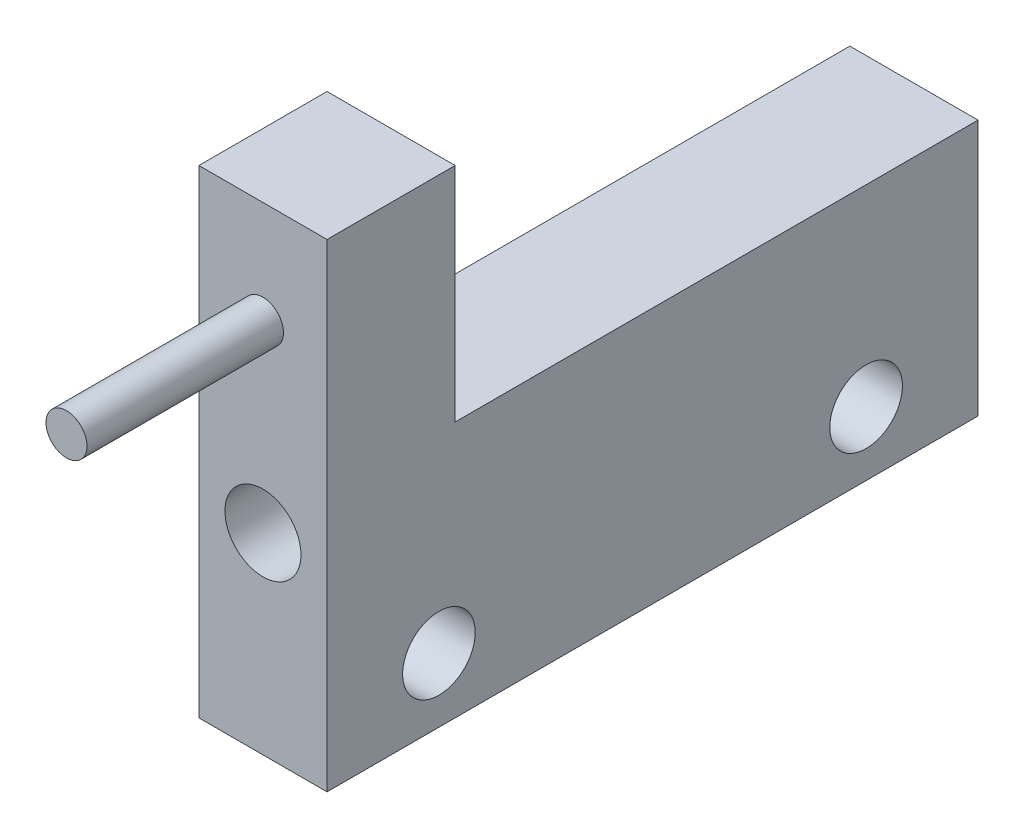
ISO-10303-21;
HEADER;
FILE_DESCRIPTION(('STEP AP214'),'2;1');
FILE_NAME('part.step','',(''),(''),'','','');
FILE_SCHEMA(('AUTOMOTIVE_DESIGN { 1 0 10303 214 1 1 1 1 }'));
ENDSEC;
DATA;
#1=APPLICATION_CONTEXT('core data for automotive mechanical design processes');
#2=APPLICATION_PROTOCOL_DEFINITION('international standard','automotive_design',2000,#1);
#3=PRODUCT_CONTEXT('',#1,'mechanical');
#4=PRODUCT('Part','Part','',(#3));
#5=PRODUCT_RELATED_PRODUCT_CATEGORY('part','',(#4));
#6=PRODUCT_DEFINITION_FORMATION('','',#4);
#7=PRODUCT_DEFINITION_CONTEXT('part definition',#1,'design');
#8=PRODUCT_DEFINITION('design','',#6,#7);
#9=PRODUCT_DEFINITION_SHAPE('','',#8);
#10=(LENGTH_UNIT() NAMED_UNIT(*) SI_UNIT(.MILLI.,.METRE.));
#11=(NAMED_UNIT(*) PLANE_ANGLE_UNIT() SI_UNIT($,.RADIAN.));
#12=(NAMED_UNIT(*) SI_UNIT($,.STERADIAN.) SOLID_ANGLE_UNIT());
#13=UNCERTAINTY_MEASURE_WITH_UNIT(LENGTH_MEASURE(1.E-05),#10,'distance_accuracy_value','');
#14=(GEOMETRIC_REPRESENTATION_CONTEXT(3) GLOBAL_UNCERTAINTY_ASSIGNED_CONTEXT((#13)) GLOBAL_UNIT_ASSIGNED_CONTEXT((#10,
#11,#12)) REPRESENTATION_CONTEXT('',''));
#15=CARTESIAN_POINT('',(0.,0.,0.));
#16=DIRECTION('',(0.,0.,1.));
#17=DIRECTION('',(1.,0.,0.));
#18=AXIS2_PLACEMENT_3D('',#15,#16,#17);
#19=CARTESIAN_POINT('',(-18.4539909866967,39.1927618098416,76.2));
#20=DIRECTION('',(0.,-1.,0.));
#21=DIRECTION('',(0.,0.,-1.));
#22=AXIS2_PLACEMENT_3D('',#19,#20,#21);
#23=PLANE('',#22);
#24=DIRECTION('',(-1.,0.,0.));
#25=VECTOR('',#24,1.);
#26=CARTESIAN_POINT('',(-3.45399098669674,39.1927618098416,61.2));
#27=LINE('',#26,#25);
#28=CARTESIAN_POINT('',(-3.45399098669674,39.1927618098416,61.2));
#29=VERTEX_POINT('',#28);
#30=CARTESIAN_POINT('',(-18.4539909866967,39.1927618098416,61.2));
#31=VERTEX_POINT('',#30);
#32=EDGE_CURVE('E51',#29,#31,#27,.T.);
#33=ORIENTED_EDGE('',*,*,#32,.F.);
#34=DIRECTION('',(0.,0.,-1.));
#35=VECTOR('',#34,1.);
#36=CARTESIAN_POINT('',(-3.45399098669674,39.1927618098416,76.2));
#37=LINE('',#36,#35);
#38=CARTESIAN_POINT('',(-3.45399098669674,39.1927618098416,0.));
#39=VERTEX_POINT('',#38);
#40=EDGE_CURVE('E87',#29,#39,#37,.T.);
#41=ORIENTED_EDGE('',*,*,#40,.T.);
#42=DIRECTION('',(-1.,0.,0.));
#43=VECTOR('',#42,1.);
#44=CARTESIAN_POINT('',(-18.4539909866967,39.1927618098416,0.));
#45=LINE('',#44,#43);
#46=CARTESIAN_POINT('',(-18.4539909866967,39.1927618098416,0.));
#47=VERTEX_POINT('',#46);
#48=EDGE_CURVE('E91',#39,#47,#45,.T.);
#49=ORIENTED_EDGE('',*,*,#48,.T.);
#50=DIRECTION('',(0.,0.,-1.));
#51=VECTOR('',#50,1.);
#52=CARTESIAN_POINT('',(-18.4539909866967,39.1927618098416,76.2));
#53=LINE('',#52,#51);
#54=EDGE_CURVE('E78',#31,#47,#53,.T.);
#55=ORIENTED_EDGE('',*,*,#54,.F.);
#56=EDGE_LOOP('',(#33,#41,#49,#55));
#57=FACE_BOUND('',#56,.T.);
#58=ADVANCED_FACE('F36',(#57),#23,.F.);
#59=CARTESIAN_POINT('',(0.,0.,76.2));
#60=DIRECTION('',(0.,0.,1.));
#61=DIRECTION('',(1.,0.,0.));
#62=AXIS2_PLACEMENT_3D('',#59,#60,#61);
#63=PLANE('',#62);
#64=CARTESIAN_POINT('',(-10.9539909866967,53.1927618098416,76.2));
#65=DIRECTION('',(0.,0.,1.));
#66=DIRECTION('',(1.,0.,0.));
#67=AXIS2_PLACEMENT_3D('',#64,#65,#66);
#68=CIRCLE('',#67,2.4);
#69=CARTESIAN_POINT('',(-8.55399098669673,53.1927618098416,76.2));
#70=VERTEX_POINT('',#69);
#71=EDGE_CURVE('E144',#70,#70,#68,.T.);
#72=ORIENTED_EDGE('',*,*,#71,.F.);
#73=EDGE_LOOP('',(#72));
#74=FACE_BOUND('',#73,.T.);
#75=DIRECTION('',(0.,-1.,0.));
#76=VECTOR('',#75,1.);
#77=CARTESIAN_POINT('',(-18.4539909866967,39.1927618098416,76.2));
#78=LINE('',#77,#76);
#79=CARTESIAN_POINT('',(-18.4539909866967,65.1927618098416,76.2));
#80=VERTEX_POINT('',#79);
#81=CARTESIAN_POINT('',(-18.4539909866967,9.19276180984159,76.2));
#82=VERTEX_POINT('',#81);
#83=EDGE_CURVE('E95',#80,#82,#78,.T.);
#84=ORIENTED_EDGE('',*,*,#83,.T.);
#85=DIRECTION('',(1.,0.,0.));
#86=VECTOR('',#85,1.);
#87=CARTESIAN_POINT('',(-18.4539909866967,9.19276180984159,76.2));
#88=LINE('',#87,#86);
#89=CARTESIAN_POINT('',(-3.45399098669673,9.19276180984159,76.2));
#90=VERTEX_POINT('',#89);
#91=EDGE_CURVE('E60',#82,#90,#88,.T.);
#92=ORIENTED_EDGE('',*,*,#91,.T.);
#93=DIRECTION('',(0.,1.,0.));
#94=VECTOR('',#93,1.);
#95=CARTESIAN_POINT('',(-3.45399098669674,39.1927618098416,76.2));
#96=LINE('',#95,#94);
#97=CARTESIAN_POINT('',(-3.45399098669673,65.1927618098416,76.2));
#98=VERTEX_POINT('',#97);
#99=EDGE_CURVE('E88',#90,#98,#96,.T.);
#100=ORIENTED_EDGE('',*,*,#99,.T.);
#101=DIRECTION('',(-1.,0.,0.));
#102=VECTOR('',#101,1.);
#103=CARTESIAN_POINT('',(-3.45399098669673,65.1927618098416,76.2));
#104=LINE('',#103,#102);
#105=EDGE_CURVE('E132',#98,#80,#104,.T.);
#106=ORIENTED_EDGE('',*,*,#105,.T.);
#107=EDGE_LOOP('',(#84,#92,#100,#106));
#108=FACE_BOUND('',#107,.T.);
#109=CARTESIAN_POINT('',(-10.9539909866967,31.6927618098416,76.2));
#110=DIRECTION('',(0.,0.,1.));
#111=DIRECTION('',(1.,0.,0.));
#112=AXIS2_PLACEMENT_3D('',#109,#110,#111);
#113=CIRCLE('',#112,4.45);
#114=CARTESIAN_POINT('',(-6.50399098669672,31.6927618098416,76.2));
#115=VERTEX_POINT('',#114);
#116=EDGE_CURVE('E101',#115,#115,#113,.T.);
#117=ORIENTED_EDGE('',*,*,#116,.F.);
#118=EDGE_LOOP('',(#117));
#119=FACE_BOUND('',#118,.T.);
#120=ADVANCED_FACE('F138',(#74,#108,#119),#63,.T.);
#121=CARTESIAN_POINT('',(0.,0.,0.));
#122=DIRECTION('',(0.,0.,1.));
#123=DIRECTION('',(1.,0.,0.));
#124=AXIS2_PLACEMENT_3D('',#121,#122,#123);
#125=PLANE('',#124);
#126=DIRECTION('',(0.,-1.,0.));
#127=VECTOR('',#126,1.);
#128=CARTESIAN_POINT('',(-18.4539909866967,39.1927618098416,0.));
#129=LINE('',#128,#127);
#130=CARTESIAN_POINT('',(-18.4539909866967,9.19276180984159,0.));
#131=VERTEX_POINT('',#130);
#132=EDGE_CURVE('E82',#47,#131,#129,.T.);
#133=ORIENTED_EDGE('',*,*,#132,.F.);
#134=ORIENTED_EDGE('',*,*,#48,.F.);
#135=DIRECTION('',(0.,1.,0.));
#136=VECTOR('',#135,1.);
#137=CARTESIAN_POINT('',(-3.45399098669674,39.1927618098416,0.));
#138=LINE('',#137,#136);
#139=CARTESIAN_POINT('',(-3.45399098669673,9.19276180984159,0.));
#140=VERTEX_POINT('',#139);
#141=EDGE_CURVE('E96',#140,#39,#138,.T.);
#142=ORIENTED_EDGE('',*,*,#141,.F.);
#143=DIRECTION('',(1.,0.,0.));
#144=VECTOR('',#143,1.);
#145=CARTESIAN_POINT('',(-18.4539909866967,9.19276180984159,0.));
#146=LINE('',#145,#144);
#147=EDGE_CURVE('E100',#131,#140,#146,.T.);
#148=ORIENTED_EDGE('',*,*,#147,.F.);
#149=EDGE_LOOP('',(#133,#134,#142,#148));
#150=FACE_BOUND('',#149,.T.);
#151=CARTESIAN_POINT('',(-10.9539909866967,31.6927618098416,0.));
#152=DIRECTION('',(0.,0.,1.));
#153=DIRECTION('',(1.,0.,0.));
#154=AXIS2_PLACEMENT_3D('',#151,#152,#153);
#155=CIRCLE('',#154,4.45);
#156=CARTESIAN_POINT('',(-6.50399098669672,31.6927618098416,0.));
#157=VERTEX_POINT('',#156);
#158=EDGE_CURVE('E105',#157,#157,#155,.T.);
#159=ORIENTED_EDGE('',*,*,#158,.T.);
#160=EDGE_LOOP('',(#159));
#161=FACE_BOUND('',#160,.T.);
#162=ADVANCED_FACE('F98',(#150,#161),#125,.F.);
#163=CARTESIAN_POINT('',(-18.4539909866967,39.1927618098416,76.2));
#164=DIRECTION('',(1.,0.,0.));
#165=DIRECTION('',(0.,1.,0.));
#166=AXIS2_PLACEMENT_3D('',#163,#164,#165);
#167=PLANE('',#166);
#168=CARTESIAN_POINT('',(-18.4539909866967,16.6927618098416,63.1));
#169=DIRECTION('',(1.,0.,0.));
#170=DIRECTION('',(0.,0.,-1.));
#171=AXIS2_PLACEMENT_3D('',#168,#169,#170);
#172=CIRCLE('',#171,4.25);
#173=CARTESIAN_POINT('',(-18.4539909866967,16.6927618098416,58.85));
#174=VERTEX_POINT('',#173);
#175=EDGE_CURVE('E151',#174,#174,#172,.T.);
#176=ORIENTED_EDGE('',*,*,#175,.T.);
#177=EDGE_LOOP('',(#176));
#178=FACE_BOUND('',#177,.T.);
#179=CARTESIAN_POINT('',(-18.4539909866967,16.6927618098416,13.1));
#180=DIRECTION('',(1.,0.,0.));
#181=DIRECTION('',(0.,0.,1.));
#182=AXIS2_PLACEMENT_3D('',#179,#180,#181);
#183=CIRCLE('',#182,4.25000000000001);
#184=CARTESIAN_POINT('',(-18.4539909866967,16.6927618098416,17.35));
#185=VERTEX_POINT('',#184);
#186=EDGE_CURVE('E157',#185,#185,#183,.T.);
#187=ORIENTED_EDGE('',*,*,#186,.T.);
#188=EDGE_LOOP('',(#187));
#189=FACE_BOUND('',#188,.T.);
#190=ORIENTED_EDGE('',*,*,#132,.T.);
#191=DIRECTION('',(0.,0.,-1.));
#192=VECTOR('',#191,1.);
#193=CARTESIAN_POINT('',(-18.4539909866967,9.19276180984159,76.2));
#194=LINE('',#193,#192);
#195=EDGE_CURVE('E11',#82,#131,#194,.T.);
#196=ORIENTED_EDGE('',*,*,#195,.F.);
#197=ORIENTED_EDGE('',*,*,#83,.F.);
#198=DIRECTION('',(0.,0.,1.));
#199=VECTOR('',#198,1.);
#200=CARTESIAN_POINT('',(-18.4539909866967,65.1927618098416,61.2));
#201=LINE('',#200,#199);
#202=CARTESIAN_POINT('',(-18.4539909866967,65.1927618098416,61.2));
#203=VERTEX_POINT('',#202);
#204=EDGE_CURVE('E122',#203,#80,#201,.T.);
#205=ORIENTED_EDGE('',*,*,#204,.F.);
#206=DIRECTION('',(0.,1.,0.));
#207=VECTOR('',#206,1.);
#208=CARTESIAN_POINT('',(-18.4539909866967,39.1927618098416,61.2));
#209=LINE('',#208,#207);
#210=EDGE_CURVE('E86',#31,#203,#209,.T.);
#211=ORIENTED_EDGE('',*,*,#210,.F.);
#212=ORIENTED_EDGE('',*,*,#54,.T.);
#213=EDGE_LOOP('',(#190,#196,#197,#205,#211,#212));
#214=FACE_BOUND('',#213,.T.);
#215=ADVANCED_FACE('F38',(#178,#189,#214),#167,.F.);
#216=CARTESIAN_POINT('',(-18.4539909866967,9.19276180984159,76.2));
#217=DIRECTION('',(0.,1.,0.));
#218=DIRECTION('',(0.,0.,1.));
#219=AXIS2_PLACEMENT_3D('',#216,#217,#218);
#220=PLANE('',#219);
#221=ORIENTED_EDGE('',*,*,#147,.T.);
#222=DIRECTION('',(0.,0.,-1.));
#223=VECTOR('',#222,1.);
#224=CARTESIAN_POINT('',(-3.45399098669673,9.19276180984159,76.2));
#225=LINE('',#224,#223);
#226=EDGE_CURVE('E44',#90,#140,#225,.T.);
#227=ORIENTED_EDGE('',*,*,#226,.F.);
#228=ORIENTED_EDGE('',*,*,#91,.F.);
#229=ORIENTED_EDGE('',*,*,#195,.T.);
#230=EDGE_LOOP('',(#221,#227,#228,#229));
#231=FACE_BOUND('',#230,.T.);
#232=ADVANCED_FACE('F117',(#231),#220,.F.);
#233=CARTESIAN_POINT('',(-3.45399098669674,39.1927618098416,76.2));
#234=DIRECTION('',(-1.,0.,0.));
#235=DIRECTION('',(0.,-1.,0.));
#236=AXIS2_PLACEMENT_3D('',#233,#234,#235);
#237=PLANE('',#236);
#238=CARTESIAN_POINT('',(-3.45399098669673,16.6927618098416,63.1));
#239=DIRECTION('',(1.,0.,0.));
#240=DIRECTION('',(0.,0.,-1.));
#241=AXIS2_PLACEMENT_3D('',#238,#239,#240);
#242=CIRCLE('',#241,4.25);
#243=CARTESIAN_POINT('',(-3.45399098669673,16.6927618098416,58.85));
#244=VERTEX_POINT('',#243);
#245=EDGE_CURVE('E154',#244,#244,#242,.T.);
#246=ORIENTED_EDGE('',*,*,#245,.F.);
#247=EDGE_LOOP('',(#246));
#248=FACE_BOUND('',#247,.T.);
#249=CARTESIAN_POINT('',(-3.45399098669673,16.6927618098416,13.1));
#250=DIRECTION('',(1.,0.,0.));
#251=DIRECTION('',(0.,0.,1.));
#252=AXIS2_PLACEMENT_3D('',#249,#250,#251);
#253=CIRCLE('',#252,4.25000000000001);
#254=CARTESIAN_POINT('',(-3.45399098669673,16.6927618098416,17.35));
#255=VERTEX_POINT('',#254);
#256=EDGE_CURVE('E149',#255,#255,#253,.T.);
#257=ORIENTED_EDGE('',*,*,#256,.F.);
#258=EDGE_LOOP('',(#257));
#259=FACE_BOUND('',#258,.T.);
#260=ORIENTED_EDGE('',*,*,#141,.T.);
#261=ORIENTED_EDGE('',*,*,#40,.F.);
#262=DIRECTION('',(0.,1.,0.));
#263=VECTOR('',#262,1.);
#264=CARTESIAN_POINT('',(-3.45399098669674,39.1927618098416,61.2));
#265=LINE('',#264,#263);
#266=CARTESIAN_POINT('',(-3.45399098669673,65.1927618098416,61.2));
#267=VERTEX_POINT('',#266);
#268=EDGE_CURVE('E136',#29,#267,#265,.T.);
#269=ORIENTED_EDGE('',*,*,#268,.T.);
#270=DIRECTION('',(0.,0.,1.));
#271=VECTOR('',#270,1.);
#272=CARTESIAN_POINT('',(-3.45399098669673,65.1927618098416,61.2));
#273=LINE('',#272,#271);
#274=EDGE_CURVE('E135',#267,#98,#273,.T.);
#275=ORIENTED_EDGE('',*,*,#274,.T.);
#276=ORIENTED_EDGE('',*,*,#99,.F.);
#277=ORIENTED_EDGE('',*,*,#226,.T.);
#278=EDGE_LOOP('',(#260,#261,#269,#275,#276,#277));
#279=FACE_BOUND('',#278,.T.);
#280=ADVANCED_FACE('F114',(#248,#259,#279),#237,.F.);
#281=CARTESIAN_POINT('',(-10.9539909866967,31.6927618098416,76.2));
#282=DIRECTION('',(0.,0.,-1.));
#283=DIRECTION('',(-1.,0.,0.));
#284=AXIS2_PLACEMENT_3D('',#281,#282,#283);
#285=CYLINDRICAL_SURFACE('',#284,4.45);
#286=ORIENTED_EDGE('',*,*,#116,.T.);
#287=EDGE_LOOP('',(#286));
#288=FACE_BOUND('',#287,.T.);
#289=ORIENTED_EDGE('',*,*,#158,.F.);
#290=EDGE_LOOP('',(#289));
#291=FACE_BOUND('',#290,.T.);
#292=ADVANCED_FACE('F165',(#288,#291),#285,.F.);
#293=CARTESIAN_POINT('',(-18.4539909866967,16.6927618098416,13.1));
#294=DIRECTION('',(1.,0.,0.));
#295=DIRECTION('',(0.,0.,-1.));
#296=AXIS2_PLACEMENT_3D('',#293,#294,#295);
#297=CYLINDRICAL_SURFACE('',#296,4.25000000000001);
#298=ORIENTED_EDGE('',*,*,#186,.F.);
#299=EDGE_LOOP('',(#298));
#300=FACE_BOUND('',#299,.T.);
#301=ORIENTED_EDGE('',*,*,#256,.T.);
#302=EDGE_LOOP('',(#301));
#303=FACE_BOUND('',#302,.T.);
#304=ADVANCED_FACE('F167',(#300,#303),#297,.F.);
#305=CARTESIAN_POINT('',(-18.4539909866967,16.6927618098416,63.1));
#306=DIRECTION('',(1.,0.,0.));
#307=DIRECTION('',(0.,0.,-1.));
#308=AXIS2_PLACEMENT_3D('',#305,#306,#307);
#309=CYLINDRICAL_SURFACE('',#308,4.25);
#310=ORIENTED_EDGE('',*,*,#175,.F.);
#311=EDGE_LOOP('',(#310));
#312=FACE_BOUND('',#311,.T.);
#313=ORIENTED_EDGE('',*,*,#245,.T.);
#314=EDGE_LOOP('',(#313));
#315=FACE_BOUND('',#314,.T.);
#316=ADVANCED_FACE('F174',(#312,#315),#309,.F.);
#317=CARTESIAN_POINT('',(-3.45399098669673,65.1927618098416,61.2));
#318=DIRECTION('',(0.,1.,0.));
#319=DIRECTION('',(0.,0.,1.));
#320=AXIS2_PLACEMENT_3D('',#317,#318,#319);
#321=PLANE('',#320);
#322=ORIENTED_EDGE('',*,*,#105,.F.);
#323=ORIENTED_EDGE('',*,*,#274,.F.);
#324=DIRECTION('',(-1.,0.,0.));
#325=VECTOR('',#324,1.);
#326=CARTESIAN_POINT('',(-3.45399098669673,65.1927618098416,61.2));
#327=LINE('',#326,#325);
#328=EDGE_CURVE('E134',#267,#203,#327,.T.);
#329=ORIENTED_EDGE('',*,*,#328,.T.);
#330=ORIENTED_EDGE('',*,*,#204,.T.);
#331=EDGE_LOOP('',(#322,#323,#329,#330));
#332=FACE_BOUND('',#331,.T.);
#333=ADVANCED_FACE('F130',(#332),#321,.T.);
#334=CARTESIAN_POINT('',(0.,0.,61.2));
#335=DIRECTION('',(0.,0.,-1.));
#336=DIRECTION('',(-1.,0.,0.));
#337=AXIS2_PLACEMENT_3D('',#334,#335,#336);
#338=PLANE('',#337);
#339=ORIENTED_EDGE('',*,*,#328,.F.);
#340=ORIENTED_EDGE('',*,*,#268,.F.);
#341=ORIENTED_EDGE('',*,*,#32,.T.);
#342=ORIENTED_EDGE('',*,*,#210,.T.);
#343=EDGE_LOOP('',(#339,#340,#341,#342));
#344=FACE_BOUND('',#343,.T.);
#345=ADVANCED_FACE('F209',(#344),#338,.T.);
#346=CARTESIAN_POINT('',(-10.9539909866967,53.1927618098416,99.2));
#347=DIRECTION('',(0.,0.,-1.));
#348=DIRECTION('',(-1.,0.,0.));
#349=AXIS2_PLACEMENT_3D('',#346,#347,#348);
#350=CYLINDRICAL_SURFACE('',#349,2.4);
#351=CARTESIAN_POINT('',(-10.9539909866967,53.1927618098416,99.2));
#352=DIRECTION('',(0.,0.,1.));
#353=DIRECTION('',(1.,0.,0.));
#354=AXIS2_PLACEMENT_3D('',#351,#352,#353);
#355=CIRCLE('',#354,2.4);
#356=CARTESIAN_POINT('',(-8.55399098669673,53.1927618098416,99.2));
#357=VERTEX_POINT('',#356);
#358=EDGE_CURVE('E140',#357,#357,#355,.T.);
#359=ORIENTED_EDGE('',*,*,#358,.F.);
#360=EDGE_LOOP('',(#359));
#361=FACE_BOUND('',#360,.T.);
#362=ORIENTED_EDGE('',*,*,#71,.T.);
#363=EDGE_LOOP('',(#362));
#364=FACE_BOUND('',#363,.T.);
#365=ADVANCED_FACE('F214',(#361,#364),#350,.T.);
#366=CARTESIAN_POINT('',(-10.9539909866967,53.1927618098416,99.2));
#367=DIRECTION('',(0.,0.,1.));
#368=DIRECTION('',(1.,0.,0.));
#369=AXIS2_PLACEMENT_3D('',#366,#367,#368);
#370=PLANE('',#369);
#371=ORIENTED_EDGE('',*,*,#358,.T.);
#372=EDGE_LOOP('',(#371));
#373=FACE_BOUND('',#372,.T.);
#374=ADVANCED_FACE('F218',(#373),#370,.T.);
#375=CLOSED_SHELL('',(#58,#120,#162,#215,#232,#280,#292,#304,#316,#333,#345,#365,#374));
#376=MANIFOLD_SOLID_BREP('B2',#375);
#377=ADVANCED_BREP_SHAPE_REPRESENTATION('',(#18,#376),#14);
#378=SHAPE_DEFINITION_REPRESENTATION(#9,#377);
ENDSEC;
END-ISO-10303-21;
